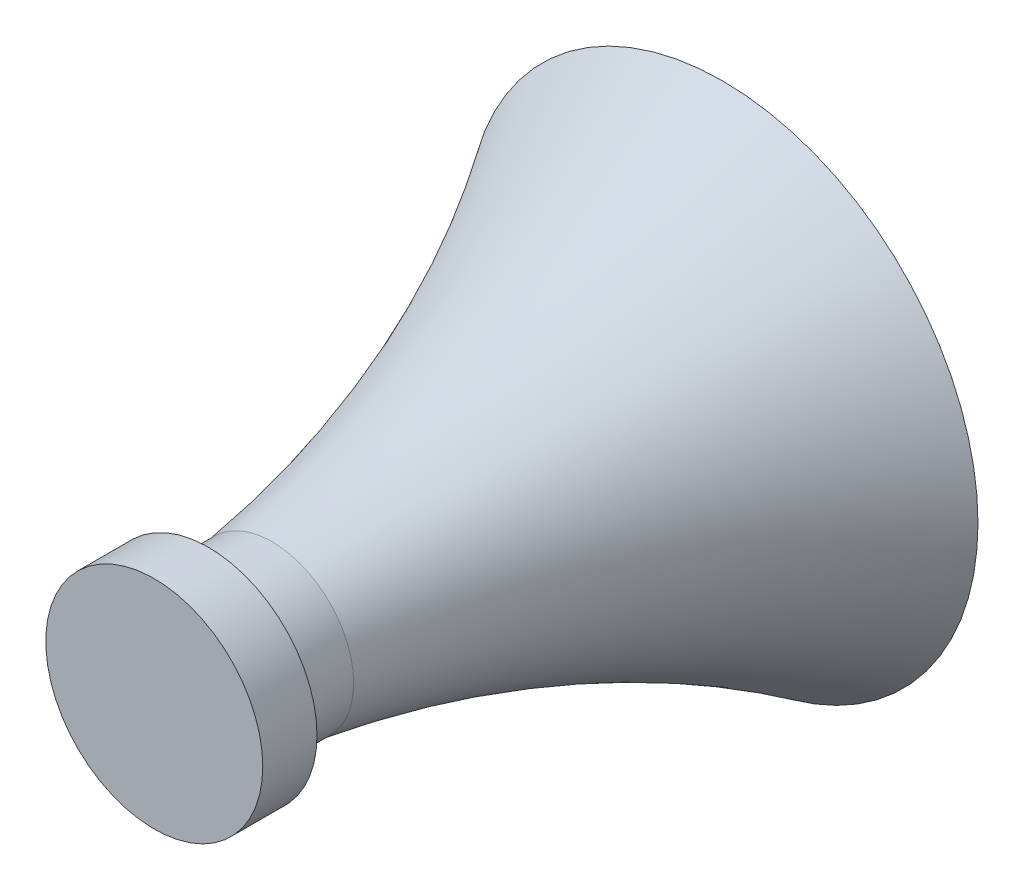
ISO-10303-21;
HEADER;
FILE_DESCRIPTION(('STEP AP214'),'2;1');
FILE_NAME('part.step','',(''),(''),'','','');
FILE_SCHEMA(('AUTOMOTIVE_DESIGN { 1 0 10303 214 1 1 1 1 }'));
ENDSEC;
DATA;
#1=APPLICATION_CONTEXT('core data for automotive mechanical design processes');
#2=APPLICATION_PROTOCOL_DEFINITION('international standard','automotive_design',2000,#1);
#3=PRODUCT_CONTEXT('',#1,'mechanical');
#4=PRODUCT('Part','Part','',(#3));
#5=PRODUCT_RELATED_PRODUCT_CATEGORY('part','',(#4));
#6=PRODUCT_DEFINITION_FORMATION('','',#4);
#7=PRODUCT_DEFINITION_CONTEXT('part definition',#1,'design');
#8=PRODUCT_DEFINITION('design','',#6,#7);
#9=PRODUCT_DEFINITION_SHAPE('','',#8);
#10=(LENGTH_UNIT() NAMED_UNIT(*) SI_UNIT(.MILLI.,.METRE.));
#11=(NAMED_UNIT(*) PLANE_ANGLE_UNIT() SI_UNIT($,.RADIAN.));
#12=(NAMED_UNIT(*) SI_UNIT($,.STERADIAN.) SOLID_ANGLE_UNIT());
#13=UNCERTAINTY_MEASURE_WITH_UNIT(LENGTH_MEASURE(1.E-05),#10,'distance_accuracy_value','');
#14=(GEOMETRIC_REPRESENTATION_CONTEXT(3) GLOBAL_UNCERTAINTY_ASSIGNED_CONTEXT((#13)) GLOBAL_UNIT_ASSIGNED_CONTEXT((#10,
#11,#12)) REPRESENTATION_CONTEXT('',''));
#15=CARTESIAN_POINT('',(0.,0.,0.));
#16=DIRECTION('',(0.,0.,1.));
#17=DIRECTION('',(1.,0.,0.));
#18=AXIS2_PLACEMENT_3D('',#15,#16,#17);
#19=CARTESIAN_POINT('',(0.,0.,3.20739392494731));
#20=DIRECTION('',(0.,0.,1.));
#21=DIRECTION('',(1.,0.,0.));
#22=AXIS2_PLACEMENT_3D('',#19,#20,#21);
#23=TOROIDAL_SURFACE('',#22,42.1126830585572,39.5);
#24=CARTESIAN_POINT('',(0.,0.,-2.34556392671133));
#25=DIRECTION('',(0.,0.,1.));
#26=DIRECTION('',(1.,0.,0.));
#27=AXIS2_PLACEMENT_3D('',#24,#25,#26);
#28=CIRCLE('',#27,3.00495160942166);
#29=CARTESIAN_POINT('',(3.00495160942166,0.,-2.34556392671133));
#30=VERTEX_POINT('',#29);
#31=EDGE_CURVE('E80',#30,#30,#28,.T.);
#32=ORIENTED_EDGE('',*,*,#31,.F.);
#33=EDGE_LOOP('',(#32));
#34=FACE_BOUND('',#33,.T.);
#35=CARTESIAN_POINT('',(0.,0.,-18.9544715845238));
#36=DIRECTION('',(0.,0.,1.));
#37=DIRECTION('',(1.,0.,0.));
#38=AXIS2_PLACEMENT_3D('',#35,#36,#37);
#39=CIRCLE('',#38,9.41556212811265);
#40=CARTESIAN_POINT('',(9.41556212811265,0.,-18.9544715845238));
#41=VERTEX_POINT('',#40);
#42=EDGE_CURVE('E10',#41,#41,#39,.T.);
#43=ORIENTED_EDGE('',*,*,#42,.T.);
#44=EDGE_LOOP('',(#43));
#45=FACE_BOUND('',#44,.T.);
#46=ADVANCED_FACE('F45',(#34,#45),#23,.F.);
#47=CARTESIAN_POINT('',(0.,0.,-18.9544715845238));
#48=DIRECTION('',(0.,0.,1.));
#49=DIRECTION('',(1.,0.,0.));
#50=AXIS2_PLACEMENT_3D('',#47,#48,#49);
#51=PLANE('',#50);
#52=ORIENTED_EDGE('',*,*,#42,.F.);
#53=EDGE_LOOP('',(#52));
#54=FACE_BOUND('',#53,.T.);
#55=CARTESIAN_POINT('',(0.,0.,-18.9544715845238));
#56=DIRECTION('',(0.,0.,1.));
#57=DIRECTION('',(1.,0.,0.));
#58=AXIS2_PLACEMENT_3D('',#55,#56,#57);
#59=CIRCLE('',#58,8.81325788123447);
#60=CARTESIAN_POINT('',(8.81325788123447,0.,-18.9544715845238));
#61=VERTEX_POINT('',#60);
#62=EDGE_CURVE('E52',#61,#61,#59,.T.);
#63=ORIENTED_EDGE('',*,*,#62,.T.);
#64=EDGE_LOOP('',(#63));
#65=FACE_BOUND('',#64,.T.);
#66=ADVANCED_FACE('F88',(#54,#65),#51,.F.);
#67=CARTESIAN_POINT('',(0.,0.,3.20739392494731));
#68=DIRECTION('',(0.,0.,1.));
#69=DIRECTION('',(1.,0.,0.));
#70=AXIS2_PLACEMENT_3D('',#67,#68,#69);
#71=TOROIDAL_SURFACE('',#70,42.1126830585572,40.);
#72=ORIENTED_EDGE('',*,*,#62,.F.);
#73=EDGE_LOOP('',(#72));
#74=FACE_BOUND('',#73,.T.);
#75=CARTESIAN_POINT('',(0.,0.,-2.34556392671132));
#76=DIRECTION('',(0.,0.,1.));
#77=DIRECTION('',(1.,0.,0.));
#78=AXIS2_PLACEMENT_3D('',#75,#76,#77);
#79=CIRCLE('',#78,2.5);
#80=CARTESIAN_POINT('',(2.5,0.,-2.34556392671132));
#81=VERTEX_POINT('',#80);
#82=EDGE_CURVE('E57',#81,#81,#79,.T.);
#83=ORIENTED_EDGE('',*,*,#82,.T.);
#84=EDGE_LOOP('',(#83));
#85=FACE_BOUND('',#84,.T.);
#86=ADVANCED_FACE('F92',(#74,#85),#71,.T.);
#87=CARTESIAN_POINT('',(0.,0.,4.07494858711753));
#88=DIRECTION('',(0.,0.,1.));
#89=DIRECTION('',(1.,0.,0.));
#90=AXIS2_PLACEMENT_3D('',#87,#88,#89);
#91=DEGENERATE_TOROIDAL_SURFACE('',#90,43.1981990827911,46.1470300274096,.F.);
#92=ORIENTED_EDGE('',*,*,#82,.F.);
#93=EDGE_LOOP('',(#92));
#94=FACE_BOUND('',#93,.T.);
#95=CARTESIAN_POINT('',(0.,0.,-10.));
#96=DIRECTION('',(0.,0.,1.));
#97=DIRECTION('',(1.,0.,0.));
#98=AXIS2_PLACEMENT_3D('',#95,#96,#97);
#99=CIRCLE('',#98,0.75);
#100=CARTESIAN_POINT('',(0.75,0.,-10.));
#101=VERTEX_POINT('',#100);
#102=EDGE_CURVE('E62',#101,#101,#99,.T.);
#103=ORIENTED_EDGE('',*,*,#102,.T.);
#104=EDGE_LOOP('',(#103));
#105=FACE_BOUND('',#104,.T.);
#106=ADVANCED_FACE('F97',(#94,#105),#91,.F.);
#107=CARTESIAN_POINT('',(0.,0.,-10.));
#108=DIRECTION('',(0.,0.,1.));
#109=DIRECTION('',(1.,0.,0.));
#110=AXIS2_PLACEMENT_3D('',#107,#108,#109);
#111=PLANE('',#110);
#112=ORIENTED_EDGE('',*,*,#102,.F.);
#113=EDGE_LOOP('',(#112));
#114=FACE_BOUND('',#113,.T.);
#115=ADVANCED_FACE('F103',(#114),#111,.F.);
#116=CARTESIAN_POINT('',(0.,0.,2.));
#117=DIRECTION('',(0.,0.,-1.));
#118=DIRECTION('',(-1.,0.,0.));
#119=AXIS2_PLACEMENT_3D('',#116,#117,#118);
#120=PLANE('',#119);
#121=CARTESIAN_POINT('',(0.,0.,2.));
#122=DIRECTION('',(0.,0.,1.));
#123=DIRECTION('',(1.,0.,0.));
#124=AXIS2_PLACEMENT_3D('',#121,#122,#123);
#125=CIRCLE('',#124,4.);
#126=CARTESIAN_POINT('',(4.,0.,2.));
#127=VERTEX_POINT('',#126);
#128=EDGE_CURVE('E68',#127,#127,#125,.T.);
#129=ORIENTED_EDGE('',*,*,#128,.T.);
#130=EDGE_LOOP('',(#129));
#131=FACE_BOUND('',#130,.T.);
#132=ADVANCED_FACE('F107',(#131),#120,.F.);
#133=CARTESIAN_POINT('',(0.,0.,2.));
#134=DIRECTION('',(0.,0.,1.));
#135=DIRECTION('',(1.,0.,0.));
#136=AXIS2_PLACEMENT_3D('',#133,#134,#135);
#137=CYLINDRICAL_SURFACE('',#136,4.);
#138=ORIENTED_EDGE('',*,*,#128,.F.);
#139=EDGE_LOOP('',(#138));
#140=FACE_BOUND('',#139,.T.);
#141=CARTESIAN_POINT('',(0.,0.,0.));
#142=DIRECTION('',(0.,0.,1.));
#143=DIRECTION('',(1.,0.,0.));
#144=AXIS2_PLACEMENT_3D('',#141,#142,#143);
#145=CIRCLE('',#144,4.);
#146=CARTESIAN_POINT('',(4.,0.,0.));
#147=VERTEX_POINT('',#146);
#148=EDGE_CURVE('E72',#147,#147,#145,.T.);
#149=ORIENTED_EDGE('',*,*,#148,.T.);
#150=EDGE_LOOP('',(#149));
#151=FACE_BOUND('',#150,.T.);
#152=ADVANCED_FACE('F111',(#140,#151),#137,.T.);
#153=CARTESIAN_POINT('',(0.,0.,0.));
#154=DIRECTION('',(0.,0.,1.));
#155=DIRECTION('',(1.,0.,0.));
#156=AXIS2_PLACEMENT_3D('',#153,#154,#155);
#157=PLANE('',#156);
#158=ORIENTED_EDGE('',*,*,#148,.F.);
#159=EDGE_LOOP('',(#158));
#160=FACE_BOUND('',#159,.T.);
#161=CARTESIAN_POINT('',(0.,0.,0.));
#162=DIRECTION('',(0.,0.,1.));
#163=DIRECTION('',(1.,0.,0.));
#164=AXIS2_PLACEMENT_3D('',#161,#162,#163);
#165=CIRCLE('',#164,3.00495160942167);
#166=CARTESIAN_POINT('',(3.00495160942167,0.,0.));
#167=VERTEX_POINT('',#166);
#168=EDGE_CURVE('E76',#167,#167,#165,.T.);
#169=ORIENTED_EDGE('',*,*,#168,.T.);
#170=EDGE_LOOP('',(#169));
#171=FACE_BOUND('',#170,.T.);
#172=ADVANCED_FACE('F115',(#160,#171),#157,.F.);
#173=CARTESIAN_POINT('',(0.,0.,2.));
#174=DIRECTION('',(0.,0.,1.));
#175=DIRECTION('',(1.,0.,0.));
#176=AXIS2_PLACEMENT_3D('',#173,#174,#175);
#177=CYLINDRICAL_SURFACE('',#176,3.00495160942167);
#178=ORIENTED_EDGE('',*,*,#168,.F.);
#179=EDGE_LOOP('',(#178));
#180=FACE_BOUND('',#179,.T.);
#181=ORIENTED_EDGE('',*,*,#31,.T.);
#182=EDGE_LOOP('',(#181));
#183=FACE_BOUND('',#182,.T.);
#184=ADVANCED_FACE('F85',(#180,#183),#177,.T.);
#185=CLOSED_SHELL('',(#46,#66,#86,#106,#115,#132,#152,#172,#184));
#186=MANIFOLD_SOLID_BREP('B2',#185);
#187=ADVANCED_BREP_SHAPE_REPRESENTATION('',(#18,#186),#14);
#188=SHAPE_DEFINITION_REPRESENTATION(#9,#187);
ENDSEC;
END-ISO-10303-21;
